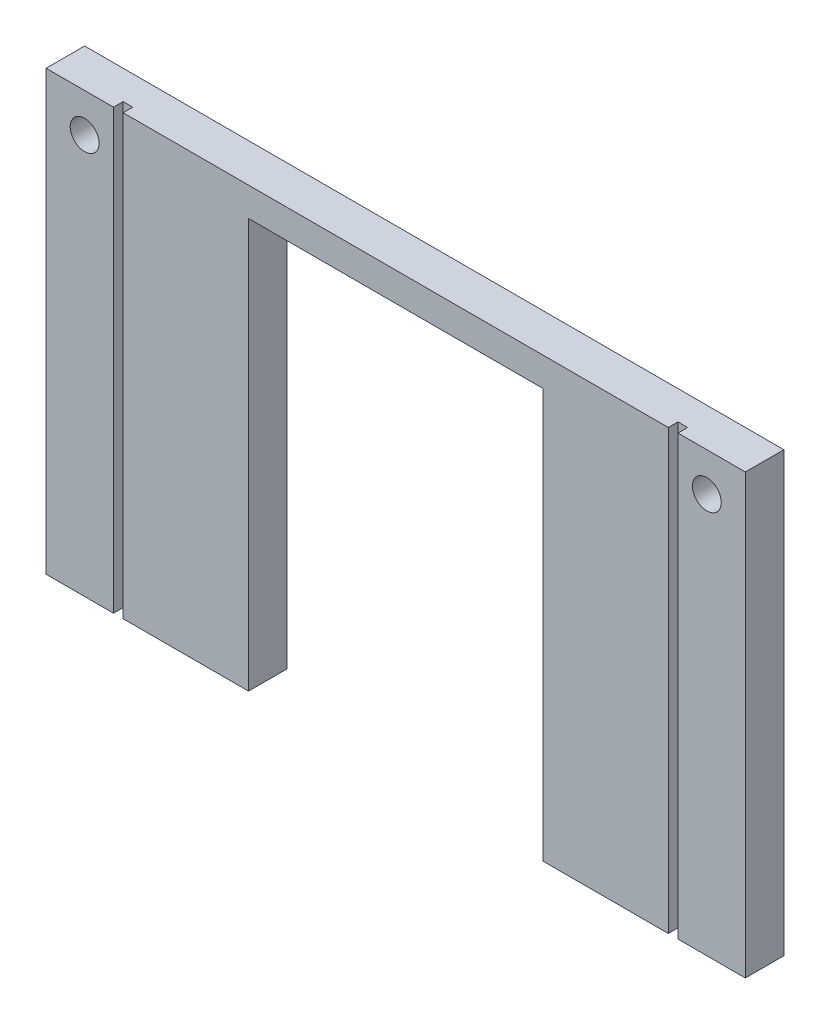
ISO-10303-21;
HEADER;
FILE_DESCRIPTION(('STEP AP214'),'2;1');
FILE_NAME('part.step','',(''),(''),'','','');
FILE_SCHEMA(('AUTOMOTIVE_DESIGN { 1 0 10303 214 1 1 1 1 }'));
ENDSEC;
DATA;
#1=APPLICATION_CONTEXT('core data for automotive mechanical design processes');
#2=APPLICATION_PROTOCOL_DEFINITION('international standard','automotive_design',2000,#1);
#3=PRODUCT_CONTEXT('',#1,'mechanical');
#4=PRODUCT('Part','Part','',(#3));
#5=PRODUCT_RELATED_PRODUCT_CATEGORY('part','',(#4));
#6=PRODUCT_DEFINITION_FORMATION('','',#4);
#7=PRODUCT_DEFINITION_CONTEXT('part definition',#1,'design');
#8=PRODUCT_DEFINITION('design','',#6,#7);
#9=PRODUCT_DEFINITION_SHAPE('','',#8);
#10=(LENGTH_UNIT() NAMED_UNIT(*) SI_UNIT(.MILLI.,.METRE.));
#11=(NAMED_UNIT(*) PLANE_ANGLE_UNIT() SI_UNIT($,.RADIAN.));
#12=(NAMED_UNIT(*) SI_UNIT($,.STERADIAN.) SOLID_ANGLE_UNIT());
#13=UNCERTAINTY_MEASURE_WITH_UNIT(LENGTH_MEASURE(1.E-05),#10,'distance_accuracy_value','');
#14=(GEOMETRIC_REPRESENTATION_CONTEXT(3) GLOBAL_UNCERTAINTY_ASSIGNED_CONTEXT((#13)) GLOBAL_UNIT_ASSIGNED_CONTEXT((#10,
#11,#12)) REPRESENTATION_CONTEXT('',''));
#15=CARTESIAN_POINT('',(0.,0.,0.));
#16=DIRECTION('',(0.,0.,1.));
#17=DIRECTION('',(1.,0.,0.));
#18=AXIS2_PLACEMENT_3D('',#15,#16,#17);
#19=CARTESIAN_POINT('',(0.,0.,4.));
#20=DIRECTION('',(0.,1.,0.));
#21=DIRECTION('',(0.,0.,1.));
#22=AXIS2_PLACEMENT_3D('',#19,#20,#21);
#23=PLANE('',#22);
#24=DIRECTION('',(1.,0.,0.));
#25=VECTOR('',#24,1.);
#26=CARTESIAN_POINT('',(0.,0.,0.));
#27=LINE('',#26,#25);
#28=CARTESIAN_POINT('',(0.,0.,0.));
#29=VERTEX_POINT('',#28);
#30=CARTESIAN_POINT('',(21.0125,0.,0.));
#31=VERTEX_POINT('',#30);
#32=EDGE_CURVE('E214',#29,#31,#27,.T.);
#33=ORIENTED_EDGE('',*,*,#32,.T.);
#34=DIRECTION('',(0.,0.,1.));
#35=VECTOR('',#34,1.);
#36=CARTESIAN_POINT('',(21.0125,0.,-52.3553304354007));
#37=LINE('',#36,#35);
#38=CARTESIAN_POINT('',(21.0125,0.,4.));
#39=VERTEX_POINT('',#38);
#40=EDGE_CURVE('E341',#31,#39,#37,.T.);
#41=ORIENTED_EDGE('',*,*,#40,.T.);
#42=DIRECTION('',(1.,0.,0.));
#43=VECTOR('',#42,1.);
#44=CARTESIAN_POINT('',(0.,0.,4.));
#45=LINE('',#44,#43);
#46=CARTESIAN_POINT('',(8.,0.,4.));
#47=VERTEX_POINT('',#46);
#48=EDGE_CURVE('E179',#47,#39,#45,.T.);
#49=ORIENTED_EDGE('',*,*,#48,.F.);
#50=DIRECTION('',(0.,0.,1.));
#51=VECTOR('',#50,1.);
#52=CARTESIAN_POINT('',(8.,0.,3.));
#53=LINE('',#52,#51);
#54=CARTESIAN_POINT('',(8.,0.,3.));
#55=VERTEX_POINT('',#54);
#56=EDGE_CURVE('E310',#55,#47,#53,.T.);
#57=ORIENTED_EDGE('',*,*,#56,.F.);
#58=DIRECTION('',(1.,0.,0.));
#59=VECTOR('',#58,1.);
#60=CARTESIAN_POINT('',(7.,0.,3.));
#61=LINE('',#60,#59);
#62=CARTESIAN_POINT('',(7.,0.,3.));
#63=VERTEX_POINT('',#62);
#64=EDGE_CURVE('E324',#63,#55,#61,.T.);
#65=ORIENTED_EDGE('',*,*,#64,.F.);
#66=DIRECTION('',(0.,0.,1.));
#67=VECTOR('',#66,1.);
#68=CARTESIAN_POINT('',(7.,0.,3.));
#69=LINE('',#68,#67);
#70=CARTESIAN_POINT('',(7.,0.,4.));
#71=VERTEX_POINT('',#70);
#72=EDGE_CURVE('E306',#63,#71,#69,.T.);
#73=ORIENTED_EDGE('',*,*,#72,.T.);
#74=CARTESIAN_POINT('',(0.,0.,4.));
#75=VERTEX_POINT('',#74);
#76=EDGE_CURVE('E182',#75,#71,#45,.T.);
#77=ORIENTED_EDGE('',*,*,#76,.F.);
#78=DIRECTION('',(0.,0.,-1.));
#79=VECTOR('',#78,1.);
#80=CARTESIAN_POINT('',(0.,0.,4.));
#81=LINE('',#80,#79);
#82=EDGE_CURVE('E11',#75,#29,#81,.T.);
#83=ORIENTED_EDGE('',*,*,#82,.T.);
#84=EDGE_LOOP('',(#33,#41,#49,#57,#65,#73,#77,#83));
#85=FACE_BOUND('',#84,.T.);
#86=ADVANCED_FACE('F38',(#85),#23,.F.);
#87=CARTESIAN_POINT('',(0.,0.,4.));
#88=DIRECTION('',(0.,0.,1.));
#89=DIRECTION('',(1.,0.,0.));
#90=AXIS2_PLACEMENT_3D('',#87,#88,#89);
#91=PLANE('',#90);
#92=DIRECTION('',(0.,-1.,0.));
#93=VECTOR('',#92,1.);
#94=CARTESIAN_POINT('',(21.0125,0.,4.));
#95=LINE('',#94,#93);
#96=CARTESIAN_POINT('',(21.0125,42.5,4.));
#97=VERTEX_POINT('',#96);
#98=EDGE_CURVE('E162',#97,#39,#95,.T.);
#99=ORIENTED_EDGE('',*,*,#98,.F.);
#100=DIRECTION('',(-1.,0.,0.));
#101=VECTOR('',#100,1.);
#102=CARTESIAN_POINT('',(21.0125,42.5,4.));
#103=LINE('',#102,#101);
#104=CARTESIAN_POINT('',(51.5875,42.5,4.));
#105=VERTEX_POINT('',#104);
#106=EDGE_CURVE('E171',#105,#97,#103,.T.);
#107=ORIENTED_EDGE('',*,*,#106,.F.);
#108=DIRECTION('',(0.,1.,0.));
#109=VECTOR('',#108,1.);
#110=CARTESIAN_POINT('',(51.5875,42.5,4.));
#111=LINE('',#110,#109);
#112=CARTESIAN_POINT('',(51.5875,0.,4.));
#113=VERTEX_POINT('',#112);
#114=EDGE_CURVE('E155',#113,#105,#111,.T.);
#115=ORIENTED_EDGE('',*,*,#114,.F.);
#116=CARTESIAN_POINT('',(64.6,0.,4.));
#117=VERTEX_POINT('',#116);
#118=EDGE_CURVE('E168',#113,#117,#45,.T.);
#119=ORIENTED_EDGE('',*,*,#118,.T.);
#120=DIRECTION('',(0.,-1.,0.));
#121=VECTOR('',#120,1.);
#122=CARTESIAN_POINT('',(64.6,0.,4.));
#123=LINE('',#122,#121);
#124=CARTESIAN_POINT('',(64.6,45.5,4.));
#125=VERTEX_POINT('',#124);
#126=EDGE_CURVE('E284',#125,#117,#123,.T.);
#127=ORIENTED_EDGE('',*,*,#126,.F.);
#128=DIRECTION('',(-1.,0.,0.));
#129=VECTOR('',#128,1.);
#130=CARTESIAN_POINT('',(72.6,45.5,4.));
#131=LINE('',#130,#129);
#132=CARTESIAN_POINT('',(8.,45.5,4.));
#133=VERTEX_POINT('',#132);
#134=EDGE_CURVE('E202',#125,#133,#131,.T.);
#135=ORIENTED_EDGE('',*,*,#134,.T.);
#136=DIRECTION('',(0.,1.,0.));
#137=VECTOR('',#136,1.);
#138=CARTESIAN_POINT('',(8.,0.,4.));
#139=LINE('',#138,#137);
#140=EDGE_CURVE('E316',#47,#133,#139,.T.);
#141=ORIENTED_EDGE('',*,*,#140,.F.);
#142=ORIENTED_EDGE('',*,*,#48,.T.);
#143=EDGE_LOOP('',(#99,#107,#115,#119,#127,#135,#141,#142));
#144=FACE_BOUND('',#143,.T.);
#145=ADVANCED_FACE('F166',(#144),#91,.T.);
#146=DIRECTION('',(0.,-1.,0.));
#147=VECTOR('',#146,1.);
#148=CARTESIAN_POINT('',(6.99999999999999,45.5,4.));
#149=LINE('',#148,#147);
#150=CARTESIAN_POINT('',(6.99999999999999,45.5,4.));
#151=VERTEX_POINT('',#150);
#152=EDGE_CURVE('E283',#151,#71,#149,.T.);
#153=ORIENTED_EDGE('',*,*,#152,.F.);
#154=CARTESIAN_POINT('',(0.,45.5,4.));
#155=VERTEX_POINT('',#154);
#156=EDGE_CURVE('E196',#151,#155,#131,.T.);
#157=ORIENTED_EDGE('',*,*,#156,.T.);
#158=DIRECTION('',(0.,-1.,0.));
#159=VECTOR('',#158,1.);
#160=CARTESIAN_POINT('',(0.,45.5,4.));
#161=LINE('',#160,#159);
#162=EDGE_CURVE('E186',#155,#75,#161,.T.);
#163=ORIENTED_EDGE('',*,*,#162,.T.);
#164=ORIENTED_EDGE('',*,*,#76,.T.);
#165=EDGE_LOOP('',(#153,#157,#163,#164));
#166=FACE_BOUND('',#165,.T.);
#167=CARTESIAN_POINT('',(4.,41.5,4.));
#168=DIRECTION('',(0.,0.,1.));
#169=DIRECTION('',(1.,0.,0.));
#170=AXIS2_PLACEMENT_3D('',#167,#168,#169);
#171=CIRCLE('',#170,1.5);
#172=CARTESIAN_POINT('',(5.5,41.5,4.));
#173=VERTEX_POINT('',#172);
#174=EDGE_CURVE('E213',#173,#173,#171,.T.);
#175=ORIENTED_EDGE('',*,*,#174,.F.);
#176=EDGE_LOOP('',(#175));
#177=FACE_BOUND('',#176,.T.);
#178=ADVANCED_FACE('F366',(#166,#177),#91,.T.);
#179=DIRECTION('',(0.,1.,0.));
#180=VECTOR('',#179,1.);
#181=CARTESIAN_POINT('',(65.6,45.5,4.));
#182=LINE('',#181,#180);
#183=CARTESIAN_POINT('',(65.6,0.,4.));
#184=VERTEX_POINT('',#183);
#185=CARTESIAN_POINT('',(65.6,45.5,4.));
#186=VERTEX_POINT('',#185);
#187=EDGE_CURVE('E288',#184,#186,#182,.T.);
#188=ORIENTED_EDGE('',*,*,#187,.F.);
#189=CARTESIAN_POINT('',(72.6,0.,4.));
#190=VERTEX_POINT('',#189);
#191=EDGE_CURVE('E180',#184,#190,#45,.T.);
#192=ORIENTED_EDGE('',*,*,#191,.T.);
#193=DIRECTION('',(0.,1.,0.));
#194=VECTOR('',#193,1.);
#195=CARTESIAN_POINT('',(72.6,0.,4.));
#196=LINE('',#195,#194);
#197=CARTESIAN_POINT('',(72.6,45.5,4.));
#198=VERTEX_POINT('',#197);
#199=EDGE_CURVE('E191',#190,#198,#196,.T.);
#200=ORIENTED_EDGE('',*,*,#199,.T.);
#201=EDGE_CURVE('E204',#198,#186,#131,.T.);
#202=ORIENTED_EDGE('',*,*,#201,.T.);
#203=EDGE_LOOP('',(#188,#192,#200,#202));
#204=FACE_BOUND('',#203,.T.);
#205=CARTESIAN_POINT('',(68.6,41.5,4.));
#206=DIRECTION('',(0.,0.,1.));
#207=DIRECTION('',(1.,0.,0.));
#208=AXIS2_PLACEMENT_3D('',#205,#206,#207);
#209=CIRCLE('',#208,1.5);
#210=CARTESIAN_POINT('',(70.1,41.5,4.));
#211=VERTEX_POINT('',#210);
#212=EDGE_CURVE('E258',#211,#211,#209,.T.);
#213=ORIENTED_EDGE('',*,*,#212,.F.);
#214=EDGE_LOOP('',(#213));
#215=FACE_BOUND('',#214,.T.);
#216=ADVANCED_FACE('F369',(#204,#215),#91,.T.);
#217=CARTESIAN_POINT('',(0.,0.,0.));
#218=DIRECTION('',(0.,0.,1.));
#219=DIRECTION('',(1.,0.,0.));
#220=AXIS2_PLACEMENT_3D('',#217,#218,#219);
#221=PLANE('',#220);
#222=DIRECTION('',(1.,0.,0.));
#223=VECTOR('',#222,1.);
#224=CARTESIAN_POINT('',(21.0125,42.5,0.));
#225=LINE('',#224,#223);
#226=CARTESIAN_POINT('',(21.0125,42.5,0.));
#227=VERTEX_POINT('',#226);
#228=CARTESIAN_POINT('',(51.5875,42.5,0.));
#229=VERTEX_POINT('',#228);
#230=EDGE_CURVE('E345',#227,#229,#225,.T.);
#231=ORIENTED_EDGE('',*,*,#230,.F.);
#232=DIRECTION('',(0.,1.,0.));
#233=VECTOR('',#232,1.);
#234=CARTESIAN_POINT('',(21.0125,0.,0.));
#235=LINE('',#234,#233);
#236=EDGE_CURVE('E334',#31,#227,#235,.T.);
#237=ORIENTED_EDGE('',*,*,#236,.F.);
#238=ORIENTED_EDGE('',*,*,#32,.F.);
#239=DIRECTION('',(0.,-1.,0.));
#240=VECTOR('',#239,1.);
#241=CARTESIAN_POINT('',(0.,45.5,0.));
#242=LINE('',#241,#240);
#243=CARTESIAN_POINT('',(0.,45.5,0.));
#244=VERTEX_POINT('',#243);
#245=EDGE_CURVE('E208',#244,#29,#242,.T.);
#246=ORIENTED_EDGE('',*,*,#245,.F.);
#247=DIRECTION('',(-1.,0.,0.));
#248=VECTOR('',#247,1.);
#249=CARTESIAN_POINT('',(72.6,45.5,0.));
#250=LINE('',#249,#248);
#251=CARTESIAN_POINT('',(72.6,45.5,0.));
#252=VERTEX_POINT('',#251);
#253=EDGE_CURVE('E221',#252,#244,#250,.T.);
#254=ORIENTED_EDGE('',*,*,#253,.F.);
#255=DIRECTION('',(0.,1.,0.));
#256=VECTOR('',#255,1.);
#257=CARTESIAN_POINT('',(72.6,0.,0.));
#258=LINE('',#257,#256);
#259=CARTESIAN_POINT('',(72.6,0.,0.));
#260=VERTEX_POINT('',#259);
#261=EDGE_CURVE('E218',#260,#252,#258,.T.);
#262=ORIENTED_EDGE('',*,*,#261,.F.);
#263=CARTESIAN_POINT('',(51.5875,0.,0.));
#264=VERTEX_POINT('',#263);
#265=EDGE_CURVE('E212',#264,#260,#27,.T.);
#266=ORIENTED_EDGE('',*,*,#265,.F.);
#267=DIRECTION('',(0.,-1.,0.));
#268=VECTOR('',#267,1.);
#269=CARTESIAN_POINT('',(51.5875,42.5,0.));
#270=LINE('',#269,#268);
#271=EDGE_CURVE('E54',#229,#264,#270,.T.);
#272=ORIENTED_EDGE('',*,*,#271,.F.);
#273=EDGE_LOOP('',(#231,#237,#238,#246,#254,#262,#266,#272));
#274=FACE_BOUND('',#273,.T.);
#275=CARTESIAN_POINT('',(4.,41.5,0.));
#276=DIRECTION('',(0.,0.,1.));
#277=DIRECTION('',(1.,0.,0.));
#278=AXIS2_PLACEMENT_3D('',#275,#276,#277);
#279=CIRCLE('',#278,1.5);
#280=CARTESIAN_POINT('',(5.5,41.5,0.));
#281=VERTEX_POINT('',#280);
#282=EDGE_CURVE('E254',#281,#281,#279,.T.);
#283=ORIENTED_EDGE('',*,*,#282,.T.);
#284=EDGE_LOOP('',(#283));
#285=FACE_BOUND('',#284,.T.);
#286=CARTESIAN_POINT('',(68.6,41.5,0.));
#287=DIRECTION('',(0.,0.,1.));
#288=DIRECTION('',(1.,0.,0.));
#289=AXIS2_PLACEMENT_3D('',#286,#287,#288);
#290=CIRCLE('',#289,1.5);
#291=CARTESIAN_POINT('',(70.1,41.5,0.));
#292=VERTEX_POINT('',#291);
#293=EDGE_CURVE('E262',#292,#292,#290,.T.);
#294=ORIENTED_EDGE('',*,*,#293,.T.);
#295=EDGE_LOOP('',(#294));
#296=FACE_BOUND('',#295,.T.);
#297=ADVANCED_FACE('F240',(#274,#285,#296),#221,.F.);
#298=CARTESIAN_POINT('',(0.,45.5,4.));
#299=DIRECTION('',(1.,0.,0.));
#300=DIRECTION('',(0.,1.,0.));
#301=AXIS2_PLACEMENT_3D('',#298,#299,#300);
#302=PLANE('',#301);
#303=ORIENTED_EDGE('',*,*,#245,.T.);
#304=ORIENTED_EDGE('',*,*,#82,.F.);
#305=ORIENTED_EDGE('',*,*,#162,.F.);
#306=DIRECTION('',(0.,0.,-1.));
#307=VECTOR('',#306,1.);
#308=CARTESIAN_POINT('',(0.,45.5,4.));
#309=LINE('',#308,#307);
#310=EDGE_CURVE('E207',#155,#244,#309,.T.);
#311=ORIENTED_EDGE('',*,*,#310,.T.);
#312=EDGE_LOOP('',(#303,#304,#305,#311));
#313=FACE_BOUND('',#312,.T.);
#314=ADVANCED_FACE('F40',(#313),#302,.F.);
#315=ORIENTED_EDGE('',*,*,#118,.F.);
#316=DIRECTION('',(0.,0.,1.));
#317=VECTOR('',#316,1.);
#318=CARTESIAN_POINT('',(51.5875,0.,-52.3553304354007));
#319=LINE('',#318,#317);
#320=EDGE_CURVE('E152',#264,#113,#319,.T.);
#321=ORIENTED_EDGE('',*,*,#320,.F.);
#322=ORIENTED_EDGE('',*,*,#265,.T.);
#323=DIRECTION('',(0.,0.,-1.));
#324=VECTOR('',#323,1.);
#325=CARTESIAN_POINT('',(72.6,0.,4.));
#326=LINE('',#325,#324);
#327=EDGE_CURVE('E47',#190,#260,#326,.T.);
#328=ORIENTED_EDGE('',*,*,#327,.F.);
#329=ORIENTED_EDGE('',*,*,#191,.F.);
#330=DIRECTION('',(0.,0.,1.));
#331=VECTOR('',#330,1.);
#332=CARTESIAN_POINT('',(65.6,0.,3.));
#333=LINE('',#332,#331);
#334=CARTESIAN_POINT('',(65.6,0.,3.));
#335=VERTEX_POINT('',#334);
#336=EDGE_CURVE('E270',#335,#184,#333,.T.);
#337=ORIENTED_EDGE('',*,*,#336,.F.);
#338=DIRECTION('',(1.,0.,0.));
#339=VECTOR('',#338,1.);
#340=CARTESIAN_POINT('',(65.6,0.,3.));
#341=LINE('',#340,#339);
#342=CARTESIAN_POINT('',(64.6,0.,3.));
#343=VERTEX_POINT('',#342);
#344=EDGE_CURVE('E287',#343,#335,#341,.T.);
#345=ORIENTED_EDGE('',*,*,#344,.F.);
#346=DIRECTION('',(0.,0.,1.));
#347=VECTOR('',#346,1.);
#348=CARTESIAN_POINT('',(64.6,0.,3.));
#349=LINE('',#348,#347);
#350=EDGE_CURVE('E177',#343,#117,#349,.T.);
#351=ORIENTED_EDGE('',*,*,#350,.T.);
#352=EDGE_LOOP('',(#315,#321,#322,#328,#329,#337,#345,#351));
#353=FACE_BOUND('',#352,.T.);
#354=ADVANCED_FACE('F175',(#353),#23,.F.);
#355=CARTESIAN_POINT('',(72.6,0.,4.));
#356=DIRECTION('',(-1.,0.,0.));
#357=DIRECTION('',(0.,0.,1.));
#358=AXIS2_PLACEMENT_3D('',#355,#356,#357);
#359=PLANE('',#358);
#360=ORIENTED_EDGE('',*,*,#261,.T.);
#361=DIRECTION('',(0.,0.,-1.));
#362=VECTOR('',#361,1.);
#363=CARTESIAN_POINT('',(72.6,45.5,4.));
#364=LINE('',#363,#362);
#365=EDGE_CURVE('E227',#198,#252,#364,.T.);
#366=ORIENTED_EDGE('',*,*,#365,.F.);
#367=ORIENTED_EDGE('',*,*,#199,.F.);
#368=ORIENTED_EDGE('',*,*,#327,.T.);
#369=EDGE_LOOP('',(#360,#366,#367,#368));
#370=FACE_BOUND('',#369,.T.);
#371=ADVANCED_FACE('F235',(#370),#359,.F.);
#372=CARTESIAN_POINT('',(72.6,45.5,4.));
#373=DIRECTION('',(0.,-1.,0.));
#374=DIRECTION('',(1.,0.,0.));
#375=AXIS2_PLACEMENT_3D('',#372,#373,#374);
#376=PLANE('',#375);
#377=DIRECTION('',(-1.,0.,0.));
#378=VECTOR('',#377,1.);
#379=CARTESIAN_POINT('',(8.,45.5,3.));
#380=LINE('',#379,#378);
#381=CARTESIAN_POINT('',(7.99999999999999,45.5,3.));
#382=VERTEX_POINT('',#381);
#383=CARTESIAN_POINT('',(6.99999999999999,45.5,3.));
#384=VERTEX_POINT('',#383);
#385=EDGE_CURVE('E319',#382,#384,#380,.T.);
#386=ORIENTED_EDGE('',*,*,#385,.F.);
#387=DIRECTION('',(0.,0.,1.));
#388=VECTOR('',#387,1.);
#389=CARTESIAN_POINT('',(8.,45.5,3.));
#390=LINE('',#389,#388);
#391=EDGE_CURVE('E266',#382,#133,#390,.T.);
#392=ORIENTED_EDGE('',*,*,#391,.T.);
#393=ORIENTED_EDGE('',*,*,#134,.F.);
#394=DIRECTION('',(0.,0.,1.));
#395=VECTOR('',#394,1.);
#396=CARTESIAN_POINT('',(64.6,45.5,3.));
#397=LINE('',#396,#395);
#398=CARTESIAN_POINT('',(64.6,45.5,3.));
#399=VERTEX_POINT('',#398);
#400=EDGE_CURVE('E278',#399,#125,#397,.T.);
#401=ORIENTED_EDGE('',*,*,#400,.F.);
#402=DIRECTION('',(-1.,0.,0.));
#403=VECTOR('',#402,1.);
#404=CARTESIAN_POINT('',(64.6,45.5,3.));
#405=LINE('',#404,#403);
#406=CARTESIAN_POINT('',(65.6,45.5,3.));
#407=VERTEX_POINT('',#406);
#408=EDGE_CURVE('E294',#407,#399,#405,.T.);
#409=ORIENTED_EDGE('',*,*,#408,.F.);
#410=DIRECTION('',(0.,0.,1.));
#411=VECTOR('',#410,1.);
#412=CARTESIAN_POINT('',(65.6,45.5,3.));
#413=LINE('',#412,#411);
#414=EDGE_CURVE('E273',#407,#186,#413,.T.);
#415=ORIENTED_EDGE('',*,*,#414,.T.);
#416=ORIENTED_EDGE('',*,*,#201,.F.);
#417=ORIENTED_EDGE('',*,*,#365,.T.);
#418=ORIENTED_EDGE('',*,*,#253,.T.);
#419=ORIENTED_EDGE('',*,*,#310,.F.);
#420=ORIENTED_EDGE('',*,*,#156,.F.);
#421=DIRECTION('',(0.,0.,1.));
#422=VECTOR('',#421,1.);
#423=CARTESIAN_POINT('',(6.99999999999999,45.5,3.));
#424=LINE('',#423,#422);
#425=EDGE_CURVE('E303',#384,#151,#424,.T.);
#426=ORIENTED_EDGE('',*,*,#425,.F.);
#427=EDGE_LOOP('',(#386,#392,#393,#401,#409,#415,#416,#417,#418,#419,#420,#426));
#428=FACE_BOUND('',#427,.T.);
#429=ADVANCED_FACE('F246',(#428),#376,.F.);
#430=CARTESIAN_POINT('',(4.,41.5,4.));
#431=DIRECTION('',(0.,0.,-1.));
#432=DIRECTION('',(-1.,0.,0.));
#433=AXIS2_PLACEMENT_3D('',#430,#431,#432);
#434=CYLINDRICAL_SURFACE('',#433,1.5);
#435=ORIENTED_EDGE('',*,*,#174,.T.);
#436=EDGE_LOOP('',(#435));
#437=FACE_BOUND('',#436,.T.);
#438=ORIENTED_EDGE('',*,*,#282,.F.);
#439=EDGE_LOOP('',(#438));
#440=FACE_BOUND('',#439,.T.);
#441=ADVANCED_FACE('F373',(#437,#440),#434,.F.);
#442=CARTESIAN_POINT('',(68.6,41.5,4.));
#443=DIRECTION('',(0.,0.,-1.));
#444=DIRECTION('',(-1.,0.,0.));
#445=AXIS2_PLACEMENT_3D('',#442,#443,#444);
#446=CYLINDRICAL_SURFACE('',#445,1.5);
#447=ORIENTED_EDGE('',*,*,#212,.T.);
#448=EDGE_LOOP('',(#447));
#449=FACE_BOUND('',#448,.T.);
#450=ORIENTED_EDGE('',*,*,#293,.F.);
#451=EDGE_LOOP('',(#450));
#452=FACE_BOUND('',#451,.T.);
#453=ADVANCED_FACE('F376',(#449,#452),#446,.F.);
#454=CARTESIAN_POINT('',(64.6,0.,3.));
#455=DIRECTION('',(-1.,0.,0.));
#456=DIRECTION('',(0.,-1.,0.));
#457=AXIS2_PLACEMENT_3D('',#454,#455,#456);
#458=PLANE('',#457);
#459=ORIENTED_EDGE('',*,*,#126,.T.);
#460=ORIENTED_EDGE('',*,*,#350,.F.);
#461=DIRECTION('',(0.,-1.,0.));
#462=VECTOR('',#461,1.);
#463=CARTESIAN_POINT('',(64.6,0.,3.));
#464=LINE('',#463,#462);
#465=EDGE_CURVE('E274',#399,#343,#464,.T.);
#466=ORIENTED_EDGE('',*,*,#465,.F.);
#467=ORIENTED_EDGE('',*,*,#400,.T.);
#468=EDGE_LOOP('',(#459,#460,#466,#467));
#469=FACE_BOUND('',#468,.T.);
#470=ADVANCED_FACE('F385',(#469),#458,.F.);
#471=CARTESIAN_POINT('',(65.6,45.5,3.));
#472=DIRECTION('',(1.,0.,0.));
#473=DIRECTION('',(0.,0.,-1.));
#474=AXIS2_PLACEMENT_3D('',#471,#472,#473);
#475=PLANE('',#474);
#476=ORIENTED_EDGE('',*,*,#187,.T.);
#477=ORIENTED_EDGE('',*,*,#414,.F.);
#478=DIRECTION('',(0.,1.,0.));
#479=VECTOR('',#478,1.);
#480=CARTESIAN_POINT('',(65.6,45.5,3.));
#481=LINE('',#480,#479);
#482=EDGE_CURVE('E297',#335,#407,#481,.T.);
#483=ORIENTED_EDGE('',*,*,#482,.F.);
#484=ORIENTED_EDGE('',*,*,#336,.T.);
#485=EDGE_LOOP('',(#476,#477,#483,#484));
#486=FACE_BOUND('',#485,.T.);
#487=ADVANCED_FACE('F391',(#486),#475,.F.);
#488=CARTESIAN_POINT('',(0.,0.,3.));
#489=DIRECTION('',(0.,0.,-1.));
#490=DIRECTION('',(-1.,0.,0.));
#491=AXIS2_PLACEMENT_3D('',#488,#489,#490);
#492=PLANE('',#491);
#493=ORIENTED_EDGE('',*,*,#344,.T.);
#494=ORIENTED_EDGE('',*,*,#482,.T.);
#495=ORIENTED_EDGE('',*,*,#408,.T.);
#496=ORIENTED_EDGE('',*,*,#465,.T.);
#497=EDGE_LOOP('',(#493,#494,#495,#496));
#498=FACE_BOUND('',#497,.T.);
#499=ADVANCED_FACE('F466',(#498),#492,.F.);
#500=CARTESIAN_POINT('',(8.,0.,3.));
#501=DIRECTION('',(1.,0.,0.));
#502=DIRECTION('',(0.,0.,-1.));
#503=AXIS2_PLACEMENT_3D('',#500,#501,#502);
#504=PLANE('',#503);
#505=ORIENTED_EDGE('',*,*,#140,.T.);
#506=ORIENTED_EDGE('',*,*,#391,.F.);
#507=DIRECTION('',(0.,1.,0.));
#508=VECTOR('',#507,1.);
#509=CARTESIAN_POINT('',(8.,0.,3.));
#510=LINE('',#509,#508);
#511=EDGE_CURVE('E62',#55,#382,#510,.T.);
#512=ORIENTED_EDGE('',*,*,#511,.F.);
#513=ORIENTED_EDGE('',*,*,#56,.T.);
#514=EDGE_LOOP('',(#505,#506,#512,#513));
#515=FACE_BOUND('',#514,.T.);
#516=ADVANCED_FACE('F474',(#515),#504,.F.);
#517=CARTESIAN_POINT('',(6.99999999999999,45.5,3.));
#518=DIRECTION('',(-1.,0.,0.));
#519=DIRECTION('',(0.,-1.,0.));
#520=AXIS2_PLACEMENT_3D('',#517,#518,#519);
#521=PLANE('',#520);
#522=ORIENTED_EDGE('',*,*,#152,.T.);
#523=ORIENTED_EDGE('',*,*,#72,.F.);
#524=DIRECTION('',(0.,-1.,0.));
#525=VECTOR('',#524,1.);
#526=CARTESIAN_POINT('',(6.99999999999999,45.5,3.));
#527=LINE('',#526,#525);
#528=EDGE_CURVE('E327',#384,#63,#527,.T.);
#529=ORIENTED_EDGE('',*,*,#528,.F.);
#530=ORIENTED_EDGE('',*,*,#425,.T.);
#531=EDGE_LOOP('',(#522,#523,#529,#530));
#532=FACE_BOUND('',#531,.T.);
#533=ADVANCED_FACE('F363',(#532),#521,.F.);
#534=CARTESIAN_POINT('',(0.,0.,3.));
#535=DIRECTION('',(0.,0.,1.));
#536=DIRECTION('',(1.,0.,0.));
#537=AXIS2_PLACEMENT_3D('',#534,#535,#536);
#538=PLANE('',#537);
#539=ORIENTED_EDGE('',*,*,#385,.T.);
#540=ORIENTED_EDGE('',*,*,#528,.T.);
#541=ORIENTED_EDGE('',*,*,#64,.T.);
#542=ORIENTED_EDGE('',*,*,#511,.T.);
#543=EDGE_LOOP('',(#539,#540,#541,#542));
#544=FACE_BOUND('',#543,.T.);
#545=ADVANCED_FACE('F364',(#544),#538,.T.);
#546=CARTESIAN_POINT('',(21.0125,0.,-52.3553304354007));
#547=DIRECTION('',(-1.,0.,0.));
#548=DIRECTION('',(0.,-1.,0.));
#549=AXIS2_PLACEMENT_3D('',#546,#547,#548);
#550=PLANE('',#549);
#551=ORIENTED_EDGE('',*,*,#236,.T.);
#552=DIRECTION('',(0.,0.,1.));
#553=VECTOR('',#552,1.);
#554=CARTESIAN_POINT('',(21.0125,42.5,-52.3553304354007));
#555=LINE('',#554,#553);
#556=EDGE_CURVE('E338',#227,#97,#555,.T.);
#557=ORIENTED_EDGE('',*,*,#556,.T.);
#558=ORIENTED_EDGE('',*,*,#98,.T.);
#559=ORIENTED_EDGE('',*,*,#40,.F.);
#560=EDGE_LOOP('',(#551,#557,#558,#559));
#561=FACE_BOUND('',#560,.T.);
#562=ADVANCED_FACE('F510',(#561),#550,.F.);
#563=CARTESIAN_POINT('',(21.0125,42.5,-52.3553304354007));
#564=DIRECTION('',(0.,1.,0.));
#565=DIRECTION('',(0.,0.,1.));
#566=AXIS2_PLACEMENT_3D('',#563,#564,#565);
#567=PLANE('',#566);
#568=ORIENTED_EDGE('',*,*,#230,.T.);
#569=DIRECTION('',(0.,0.,1.));
#570=VECTOR('',#569,1.);
#571=CARTESIAN_POINT('',(51.5875,42.5,-52.3553304354007));
#572=LINE('',#571,#570);
#573=EDGE_CURVE('E161',#229,#105,#572,.T.);
#574=ORIENTED_EDGE('',*,*,#573,.T.);
#575=ORIENTED_EDGE('',*,*,#106,.T.);
#576=ORIENTED_EDGE('',*,*,#556,.F.);
#577=EDGE_LOOP('',(#568,#574,#575,#576));
#578=FACE_BOUND('',#577,.T.);
#579=ADVANCED_FACE('F355',(#578),#567,.F.);
#580=CARTESIAN_POINT('',(51.5875,42.5,-52.3553304354007));
#581=DIRECTION('',(1.,0.,0.));
#582=DIRECTION('',(0.,1.,0.));
#583=AXIS2_PLACEMENT_3D('',#580,#581,#582);
#584=PLANE('',#583);
#585=ORIENTED_EDGE('',*,*,#271,.T.);
#586=ORIENTED_EDGE('',*,*,#320,.T.);
#587=ORIENTED_EDGE('',*,*,#114,.T.);
#588=ORIENTED_EDGE('',*,*,#573,.F.);
#589=EDGE_LOOP('',(#585,#586,#587,#588));
#590=FACE_BOUND('',#589,.T.);
#591=ADVANCED_FACE('F154',(#590),#584,.F.);
#592=CLOSED_SHELL('',(#86,#145,#178,#216,#297,#314,#354,#371,#429,#441,#453,#470,#487,#499,#516,
#533,#545,#562,#579,#591));
#593=MANIFOLD_SOLID_BREP('B2',#592);
#594=ADVANCED_BREP_SHAPE_REPRESENTATION('',(#18,#593),#14);
#595=SHAPE_DEFINITION_REPRESENTATION(#9,#594);
ENDSEC;
END-ISO-10303-21;
